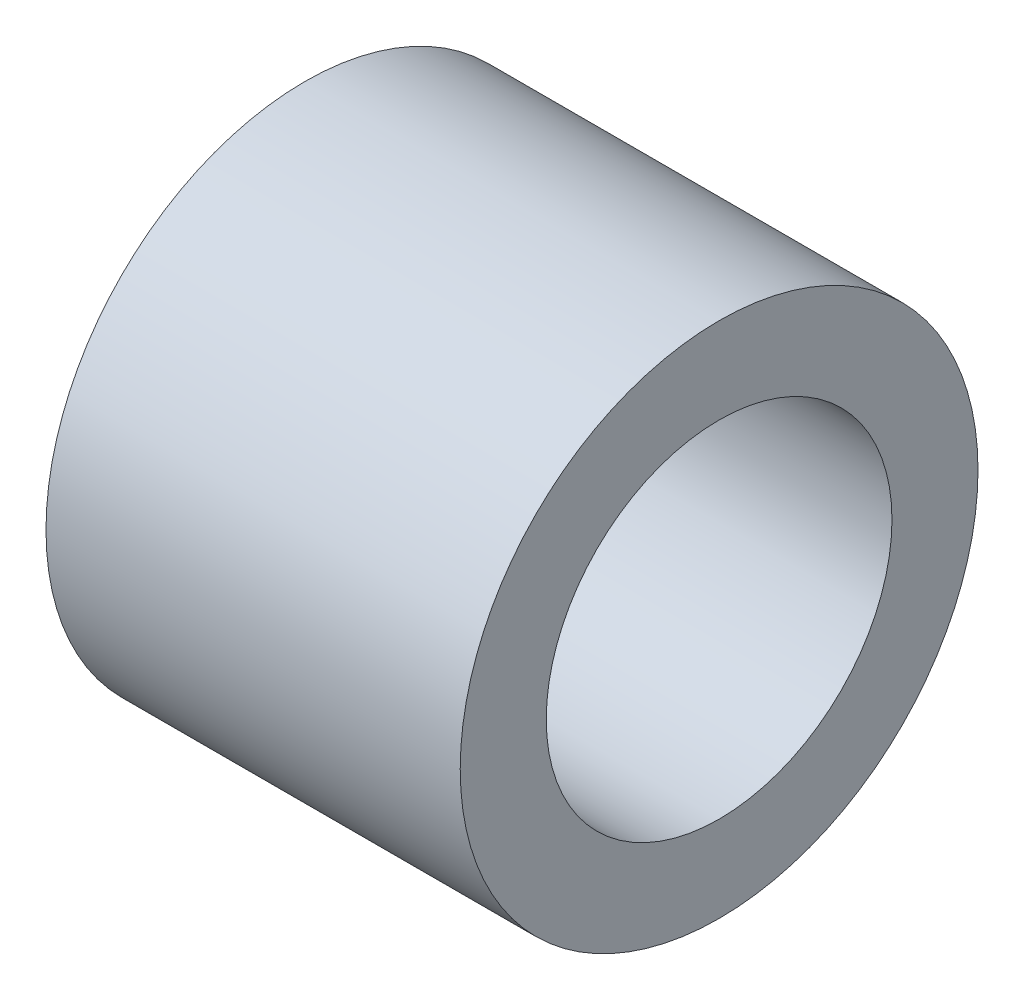
ISO-10303-21;
HEADER;
FILE_DESCRIPTION(('STEP AP214'),'2;1');
FILE_NAME('part.step','',(''),(''),'','','');
FILE_SCHEMA(('AUTOMOTIVE_DESIGN { 1 0 10303 214 1 1 1 1 }'));
ENDSEC;
DATA;
#1=APPLICATION_CONTEXT('core data for automotive mechanical design processes');
#2=APPLICATION_PROTOCOL_DEFINITION('international standard','automotive_design',2000,#1);
#3=PRODUCT_CONTEXT('',#1,'mechanical');
#4=PRODUCT('Part','Part','',(#3));
#5=PRODUCT_RELATED_PRODUCT_CATEGORY('part','',(#4));
#6=PRODUCT_DEFINITION_FORMATION('','',#4);
#7=PRODUCT_DEFINITION_CONTEXT('part definition',#1,'design');
#8=PRODUCT_DEFINITION('design','',#6,#7);
#9=PRODUCT_DEFINITION_SHAPE('','',#8);
#10=(LENGTH_UNIT() NAMED_UNIT(*) SI_UNIT(.MILLI.,.METRE.));
#11=(NAMED_UNIT(*) PLANE_ANGLE_UNIT() SI_UNIT($,.RADIAN.));
#12=(NAMED_UNIT(*) SI_UNIT($,.STERADIAN.) SOLID_ANGLE_UNIT());
#13=UNCERTAINTY_MEASURE_WITH_UNIT(LENGTH_MEASURE(1.E-05),#10,'distance_accuracy_value','');
#14=(GEOMETRIC_REPRESENTATION_CONTEXT(3) GLOBAL_UNCERTAINTY_ASSIGNED_CONTEXT((#13)) GLOBAL_UNIT_ASSIGNED_CONTEXT((#10,
#11,#12)) REPRESENTATION_CONTEXT('',''));
#15=CARTESIAN_POINT('',(0.,0.,0.));
#16=DIRECTION('',(0.,0.,1.));
#17=DIRECTION('',(1.,0.,0.));
#18=AXIS2_PLACEMENT_3D('',#15,#16,#17);
#19=CARTESIAN_POINT('',(6.35,0.,0.));
#20=DIRECTION('',(1.,0.,0.));
#21=DIRECTION('',(0.,0.,-1.));
#22=AXIS2_PLACEMENT_3D('',#19,#20,#21);
#23=PLANE('',#22);
#24=CARTESIAN_POINT('',(6.35,0.,0.));
#25=DIRECTION('',(1.,0.,0.));
#26=DIRECTION('',(0.,0.,-1.));
#27=AXIS2_PLACEMENT_3D('',#24,#25,#26);
#28=CIRCLE('',#27,3.96875);
#29=CARTESIAN_POINT('',(6.35,0.,-3.96875));
#30=VERTEX_POINT('',#29);
#31=EDGE_CURVE('E10',#30,#30,#28,.T.);
#32=ORIENTED_EDGE('',*,*,#31,.T.);
#33=EDGE_LOOP('',(#32));
#34=FACE_BOUND('',#33,.T.);
#35=CARTESIAN_POINT('',(6.35,0.,0.));
#36=DIRECTION('',(1.,0.,0.));
#37=DIRECTION('',(0.,0.,-1.));
#38=AXIS2_PLACEMENT_3D('',#35,#36,#37);
#39=CIRCLE('',#38,2.65);
#40=CARTESIAN_POINT('',(6.35,0.,-2.65));
#41=VERTEX_POINT('',#40);
#42=EDGE_CURVE('E42',#41,#41,#39,.T.);
#43=ORIENTED_EDGE('',*,*,#42,.F.);
#44=EDGE_LOOP('',(#43));
#45=FACE_BOUND('',#44,.T.);
#46=ADVANCED_FACE('F31',(#34,#45),#23,.T.);
#47=CARTESIAN_POINT('',(0.,0.,0.));
#48=DIRECTION('',(1.,0.,0.));
#49=DIRECTION('',(0.,0.,-1.));
#50=AXIS2_PLACEMENT_3D('',#47,#48,#49);
#51=PLANE('',#50);
#52=CARTESIAN_POINT('',(0.,0.,0.));
#53=DIRECTION('',(1.,0.,0.));
#54=DIRECTION('',(0.,0.,-1.));
#55=AXIS2_PLACEMENT_3D('',#52,#53,#54);
#56=CIRCLE('',#55,3.96875);
#57=CARTESIAN_POINT('',(0.,0.,-3.96875));
#58=VERTEX_POINT('',#57);
#59=EDGE_CURVE('E35',#58,#58,#56,.T.);
#60=ORIENTED_EDGE('',*,*,#59,.F.);
#61=EDGE_LOOP('',(#60));
#62=FACE_BOUND('',#61,.T.);
#63=CARTESIAN_POINT('',(0.,0.,0.));
#64=DIRECTION('',(1.,0.,0.));
#65=DIRECTION('',(0.,0.,-1.));
#66=AXIS2_PLACEMENT_3D('',#63,#64,#65);
#67=CIRCLE('',#66,2.65);
#68=CARTESIAN_POINT('',(0.,0.,-2.65));
#69=VERTEX_POINT('',#68);
#70=EDGE_CURVE('E44',#69,#69,#67,.T.);
#71=ORIENTED_EDGE('',*,*,#70,.T.);
#72=EDGE_LOOP('',(#71));
#73=FACE_BOUND('',#72,.T.);
#74=ADVANCED_FACE('F54',(#62,#73),#51,.F.);
#75=CARTESIAN_POINT('',(6.35,0.,0.));
#76=DIRECTION('',(-1.,0.,0.));
#77=DIRECTION('',(0.,0.,1.));
#78=AXIS2_PLACEMENT_3D('',#75,#76,#77);
#79=CYLINDRICAL_SURFACE('',#78,3.96875);
#80=ORIENTED_EDGE('',*,*,#31,.F.);
#81=EDGE_LOOP('',(#80));
#82=FACE_BOUND('',#81,.T.);
#83=ORIENTED_EDGE('',*,*,#59,.T.);
#84=EDGE_LOOP('',(#83));
#85=FACE_BOUND('',#84,.T.);
#86=ADVANCED_FACE('F33',(#82,#85),#79,.T.);
#87=CARTESIAN_POINT('',(6.35,0.,0.));
#88=DIRECTION('',(-1.,0.,0.));
#89=DIRECTION('',(0.,0.,1.));
#90=AXIS2_PLACEMENT_3D('',#87,#88,#89);
#91=CYLINDRICAL_SURFACE('',#90,2.65);
#92=ORIENTED_EDGE('',*,*,#42,.T.);
#93=EDGE_LOOP('',(#92));
#94=FACE_BOUND('',#93,.T.);
#95=ORIENTED_EDGE('',*,*,#70,.F.);
#96=EDGE_LOOP('',(#95));
#97=FACE_BOUND('',#96,.T.);
#98=ADVANCED_FACE('F50',(#94,#97),#91,.F.);
#99=CLOSED_SHELL('',(#46,#74,#86,#98));
#100=MANIFOLD_SOLID_BREP('B2',#99);
#101=ADVANCED_BREP_SHAPE_REPRESENTATION('',(#18,#100),#14);
#102=SHAPE_DEFINITION_REPRESENTATION(#9,#101);
ENDSEC;
END-ISO-10303-21;
